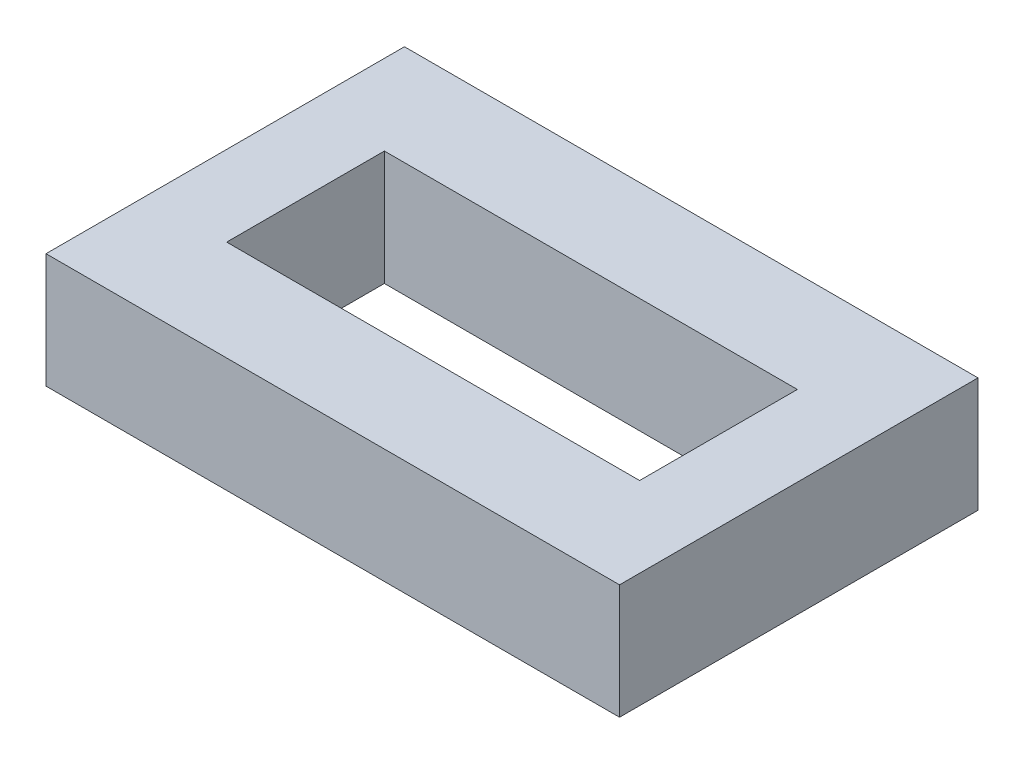
ISO-10303-21;
HEADER;
FILE_DESCRIPTION(('STEP AP214'),'2;1');
FILE_NAME('part.step','',(''),(''),'','','');
FILE_SCHEMA(('AUTOMOTIVE_DESIGN { 1 0 10303 214 1 1 1 1 }'));
ENDSEC;
DATA;
#1=APPLICATION_CONTEXT('core data for automotive mechanical design processes');
#2=APPLICATION_PROTOCOL_DEFINITION('international standard','automotive_design',2000,#1);
#3=PRODUCT_CONTEXT('',#1,'mechanical');
#4=PRODUCT('Part','Part','',(#3));
#5=PRODUCT_RELATED_PRODUCT_CATEGORY('part','',(#4));
#6=PRODUCT_DEFINITION_FORMATION('','',#4);
#7=PRODUCT_DEFINITION_CONTEXT('part definition',#1,'design');
#8=PRODUCT_DEFINITION('design','',#6,#7);
#9=PRODUCT_DEFINITION_SHAPE('','',#8);
#10=(LENGTH_UNIT() NAMED_UNIT(*) SI_UNIT(.MILLI.,.METRE.));
#11=(NAMED_UNIT(*) PLANE_ANGLE_UNIT() SI_UNIT($,.RADIAN.));
#12=(NAMED_UNIT(*) SI_UNIT($,.STERADIAN.) SOLID_ANGLE_UNIT());
#13=UNCERTAINTY_MEASURE_WITH_UNIT(LENGTH_MEASURE(1.E-05),#10,'distance_accuracy_value','');
#14=(GEOMETRIC_REPRESENTATION_CONTEXT(3) GLOBAL_UNCERTAINTY_ASSIGNED_CONTEXT((#13)) GLOBAL_UNIT_ASSIGNED_CONTEXT((#10,
#11,#12)) REPRESENTATION_CONTEXT('',''));
#15=CARTESIAN_POINT('',(0.,0.,0.));
#16=DIRECTION('',(0.,0.,1.));
#17=DIRECTION('',(1.,0.,0.));
#18=AXIS2_PLACEMENT_3D('',#15,#16,#17);
#19=CARTESIAN_POINT('',(0.,10.16,0.));
#20=DIRECTION('',(0.,-1.,0.));
#21=DIRECTION('',(0.,0.,-1.));
#22=AXIS2_PLACEMENT_3D('',#19,#20,#21);
#23=PLANE('',#22);
#24=DIRECTION('',(0.,0.,-1.));
#25=VECTOR('',#24,1.);
#26=CARTESIAN_POINT('',(25.4,10.16,15.875));
#27=LINE('',#26,#25);
#28=CARTESIAN_POINT('',(25.4,10.16,15.875));
#29=VERTEX_POINT('',#28);
#30=CARTESIAN_POINT('',(25.4,10.16,-15.875));
#31=VERTEX_POINT('',#30);
#32=EDGE_CURVE('E134',#29,#31,#27,.T.);
#33=ORIENTED_EDGE('',*,*,#32,.T.);
#34=DIRECTION('',(-1.,0.,0.));
#35=VECTOR('',#34,1.);
#36=CARTESIAN_POINT('',(-25.4,10.16,-15.875));
#37=LINE('',#36,#35);
#38=CARTESIAN_POINT('',(-25.4,10.16,-15.875));
#39=VERTEX_POINT('',#38);
#40=EDGE_CURVE('E137',#31,#39,#37,.T.);
#41=ORIENTED_EDGE('',*,*,#40,.T.);
#42=DIRECTION('',(0.,0.,1.));
#43=VECTOR('',#42,1.);
#44=CARTESIAN_POINT('',(-25.4,10.16,15.875));
#45=LINE('',#44,#43);
#46=CARTESIAN_POINT('',(-25.4,10.16,15.875));
#47=VERTEX_POINT('',#46);
#48=EDGE_CURVE('E140',#39,#47,#45,.T.);
#49=ORIENTED_EDGE('',*,*,#48,.T.);
#50=DIRECTION('',(1.,0.,0.));
#51=VECTOR('',#50,1.);
#52=CARTESIAN_POINT('',(-25.4,10.16,15.875));
#53=LINE('',#52,#51);
#54=EDGE_CURVE('E142',#47,#29,#53,.T.);
#55=ORIENTED_EDGE('',*,*,#54,.T.);
#56=EDGE_LOOP('',(#33,#41,#49,#55));
#57=FACE_BOUND('',#56,.T.);
#58=DIRECTION('',(0.,0.,-1.));
#59=VECTOR('',#58,1.);
#60=CARTESIAN_POINT('',(18.288,10.16,6.985));
#61=LINE('',#60,#59);
#62=CARTESIAN_POINT('',(18.288,10.16,6.985));
#63=VERTEX_POINT('',#62);
#64=CARTESIAN_POINT('',(18.288,10.16,-6.985));
#65=VERTEX_POINT('',#64);
#66=EDGE_CURVE('E98',#63,#65,#61,.T.);
#67=ORIENTED_EDGE('',*,*,#66,.F.);
#68=DIRECTION('',(1.,0.,0.));
#69=VECTOR('',#68,1.);
#70=CARTESIAN_POINT('',(-18.288,10.16,6.985));
#71=LINE('',#70,#69);
#72=CARTESIAN_POINT('',(-18.288,10.16,6.985));
#73=VERTEX_POINT('',#72);
#74=EDGE_CURVE('E120',#73,#63,#71,.T.);
#75=ORIENTED_EDGE('',*,*,#74,.F.);
#76=DIRECTION('',(0.,0.,1.));
#77=VECTOR('',#76,1.);
#78=CARTESIAN_POINT('',(-18.288,10.16,6.985));
#79=LINE('',#78,#77);
#80=CARTESIAN_POINT('',(-18.288,10.16,-6.985));
#81=VERTEX_POINT('',#80);
#82=EDGE_CURVE('E118',#81,#73,#79,.T.);
#83=ORIENTED_EDGE('',*,*,#82,.F.);
#84=DIRECTION('',(-1.,0.,0.));
#85=VECTOR('',#84,1.);
#86=CARTESIAN_POINT('',(-18.288,10.16,-6.985));
#87=LINE('',#86,#85);
#88=EDGE_CURVE('E106',#65,#81,#87,.T.);
#89=ORIENTED_EDGE('',*,*,#88,.F.);
#90=EDGE_LOOP('',(#67,#75,#83,#89));
#91=FACE_BOUND('',#90,.T.);
#92=ADVANCED_FACE('F33',(#57,#91),#23,.F.);
#93=CARTESIAN_POINT('',(0.,0.,0.));
#94=DIRECTION('',(0.,-1.,0.));
#95=DIRECTION('',(0.,0.,-1.));
#96=AXIS2_PLACEMENT_3D('',#93,#94,#95);
#97=PLANE('',#96);
#98=DIRECTION('',(0.,0.,-1.));
#99=VECTOR('',#98,1.);
#100=CARTESIAN_POINT('',(25.4,0.,15.875));
#101=LINE('',#100,#99);
#102=CARTESIAN_POINT('',(25.4,0.,15.875));
#103=VERTEX_POINT('',#102);
#104=CARTESIAN_POINT('',(25.4,0.,-15.875));
#105=VERTEX_POINT('',#104);
#106=EDGE_CURVE('E114',#103,#105,#101,.T.);
#107=ORIENTED_EDGE('',*,*,#106,.F.);
#108=DIRECTION('',(1.,0.,0.));
#109=VECTOR('',#108,1.);
#110=CARTESIAN_POINT('',(-25.4,0.,15.875));
#111=LINE('',#110,#109);
#112=CARTESIAN_POINT('',(-25.4,0.,15.875));
#113=VERTEX_POINT('',#112);
#114=EDGE_CURVE('E138',#113,#103,#111,.T.);
#115=ORIENTED_EDGE('',*,*,#114,.F.);
#116=DIRECTION('',(0.,0.,1.));
#117=VECTOR('',#116,1.);
#118=CARTESIAN_POINT('',(-25.4,0.,15.875));
#119=LINE('',#118,#117);
#120=CARTESIAN_POINT('',(-25.4,0.,-15.875));
#121=VERTEX_POINT('',#120);
#122=EDGE_CURVE('E149',#121,#113,#119,.T.);
#123=ORIENTED_EDGE('',*,*,#122,.F.);
#124=DIRECTION('',(-1.,0.,0.));
#125=VECTOR('',#124,1.);
#126=CARTESIAN_POINT('',(-25.4,0.,-15.875));
#127=LINE('',#126,#125);
#128=EDGE_CURVE('E147',#105,#121,#127,.T.);
#129=ORIENTED_EDGE('',*,*,#128,.F.);
#130=EDGE_LOOP('',(#107,#115,#123,#129));
#131=FACE_BOUND('',#130,.T.);
#132=DIRECTION('',(1.,0.,0.));
#133=VECTOR('',#132,1.);
#134=CARTESIAN_POINT('',(-18.288,0.,6.985));
#135=LINE('',#134,#133);
#136=CARTESIAN_POINT('',(-18.288,0.,6.985));
#137=VERTEX_POINT('',#136);
#138=CARTESIAN_POINT('',(18.288,0.,6.985));
#139=VERTEX_POINT('',#138);
#140=EDGE_CURVE('E107',#137,#139,#135,.T.);
#141=ORIENTED_EDGE('',*,*,#140,.T.);
#142=DIRECTION('',(0.,0.,-1.));
#143=VECTOR('',#142,1.);
#144=CARTESIAN_POINT('',(18.288,0.,6.985));
#145=LINE('',#144,#143);
#146=CARTESIAN_POINT('',(18.288,0.,-6.985));
#147=VERTEX_POINT('',#146);
#148=EDGE_CURVE('E56',#139,#147,#145,.T.);
#149=ORIENTED_EDGE('',*,*,#148,.T.);
#150=DIRECTION('',(-1.,0.,0.));
#151=VECTOR('',#150,1.);
#152=CARTESIAN_POINT('',(-18.288,0.,-6.985));
#153=LINE('',#152,#151);
#154=CARTESIAN_POINT('',(-18.288,0.,-6.985));
#155=VERTEX_POINT('',#154);
#156=EDGE_CURVE('E113',#147,#155,#153,.T.);
#157=ORIENTED_EDGE('',*,*,#156,.T.);
#158=DIRECTION('',(0.,0.,1.));
#159=VECTOR('',#158,1.);
#160=CARTESIAN_POINT('',(-18.288,0.,6.985));
#161=LINE('',#160,#159);
#162=EDGE_CURVE('E126',#155,#137,#161,.T.);
#163=ORIENTED_EDGE('',*,*,#162,.T.);
#164=EDGE_LOOP('',(#141,#149,#157,#163));
#165=FACE_BOUND('',#164,.T.);
#166=ADVANCED_FACE('F167',(#131,#165),#97,.T.);
#167=CARTESIAN_POINT('',(25.4,10.16,15.875));
#168=DIRECTION('',(-1.,0.,0.));
#169=DIRECTION('',(0.,0.,1.));
#170=AXIS2_PLACEMENT_3D('',#167,#168,#169);
#171=PLANE('',#170);
#172=ORIENTED_EDGE('',*,*,#106,.T.);
#173=DIRECTION('',(0.,-1.,0.));
#174=VECTOR('',#173,1.);
#175=CARTESIAN_POINT('',(25.4,10.16,-15.875));
#176=LINE('',#175,#174);
#177=EDGE_CURVE('E11',#31,#105,#176,.T.);
#178=ORIENTED_EDGE('',*,*,#177,.F.);
#179=ORIENTED_EDGE('',*,*,#32,.F.);
#180=DIRECTION('',(0.,-1.,0.));
#181=VECTOR('',#180,1.);
#182=CARTESIAN_POINT('',(25.4,10.16,15.875));
#183=LINE('',#182,#181);
#184=EDGE_CURVE('E144',#29,#103,#183,.T.);
#185=ORIENTED_EDGE('',*,*,#184,.T.);
#186=EDGE_LOOP('',(#172,#178,#179,#185));
#187=FACE_BOUND('',#186,.T.);
#188=ADVANCED_FACE('F35',(#187),#171,.F.);
#189=CARTESIAN_POINT('',(-25.4,10.16,-15.875));
#190=DIRECTION('',(0.,0.,1.));
#191=DIRECTION('',(1.,0.,0.));
#192=AXIS2_PLACEMENT_3D('',#189,#190,#191);
#193=PLANE('',#192);
#194=ORIENTED_EDGE('',*,*,#128,.T.);
#195=DIRECTION('',(0.,-1.,0.));
#196=VECTOR('',#195,1.);
#197=CARTESIAN_POINT('',(-25.4,10.16,-15.875));
#198=LINE('',#197,#196);
#199=EDGE_CURVE('E41',#39,#121,#198,.T.);
#200=ORIENTED_EDGE('',*,*,#199,.F.);
#201=ORIENTED_EDGE('',*,*,#40,.F.);
#202=ORIENTED_EDGE('',*,*,#177,.T.);
#203=EDGE_LOOP('',(#194,#200,#201,#202));
#204=FACE_BOUND('',#203,.T.);
#205=ADVANCED_FACE('F177',(#204),#193,.F.);
#206=CARTESIAN_POINT('',(-25.4,10.16,15.875));
#207=DIRECTION('',(1.,0.,0.));
#208=DIRECTION('',(0.,0.,-1.));
#209=AXIS2_PLACEMENT_3D('',#206,#207,#208);
#210=PLANE('',#209);
#211=ORIENTED_EDGE('',*,*,#122,.T.);
#212=DIRECTION('',(0.,-1.,0.));
#213=VECTOR('',#212,1.);
#214=CARTESIAN_POINT('',(-25.4,10.16,15.875));
#215=LINE('',#214,#213);
#216=EDGE_CURVE('E154',#47,#113,#215,.T.);
#217=ORIENTED_EDGE('',*,*,#216,.F.);
#218=ORIENTED_EDGE('',*,*,#48,.F.);
#219=ORIENTED_EDGE('',*,*,#199,.T.);
#220=EDGE_LOOP('',(#211,#217,#218,#219));
#221=FACE_BOUND('',#220,.T.);
#222=ADVANCED_FACE('F161',(#221),#210,.F.);
#223=CARTESIAN_POINT('',(-25.4,10.16,15.875));
#224=DIRECTION('',(0.,0.,-1.));
#225=DIRECTION('',(-1.,0.,0.));
#226=AXIS2_PLACEMENT_3D('',#223,#224,#225);
#227=PLANE('',#226);
#228=ORIENTED_EDGE('',*,*,#114,.T.);
#229=ORIENTED_EDGE('',*,*,#184,.F.);
#230=ORIENTED_EDGE('',*,*,#54,.F.);
#231=ORIENTED_EDGE('',*,*,#216,.T.);
#232=EDGE_LOOP('',(#228,#229,#230,#231));
#233=FACE_BOUND('',#232,.T.);
#234=ADVANCED_FACE('F171',(#233),#227,.F.);
#235=CARTESIAN_POINT('',(18.288,10.16,6.985));
#236=DIRECTION('',(-1.,0.,0.));
#237=DIRECTION('',(0.,0.,1.));
#238=AXIS2_PLACEMENT_3D('',#235,#236,#237);
#239=PLANE('',#238);
#240=ORIENTED_EDGE('',*,*,#148,.F.);
#241=DIRECTION('',(0.,-1.,0.));
#242=VECTOR('',#241,1.);
#243=CARTESIAN_POINT('',(18.288,10.16,6.985));
#244=LINE('',#243,#242);
#245=EDGE_CURVE('E102',#63,#139,#244,.T.);
#246=ORIENTED_EDGE('',*,*,#245,.F.);
#247=ORIENTED_EDGE('',*,*,#66,.T.);
#248=DIRECTION('',(0.,-1.,0.));
#249=VECTOR('',#248,1.);
#250=CARTESIAN_POINT('',(18.288,10.16,-6.985));
#251=LINE('',#250,#249);
#252=EDGE_CURVE('E101',#65,#147,#251,.T.);
#253=ORIENTED_EDGE('',*,*,#252,.T.);
#254=EDGE_LOOP('',(#240,#246,#247,#253));
#255=FACE_BOUND('',#254,.T.);
#256=ADVANCED_FACE('F100',(#255),#239,.T.);
#257=CARTESIAN_POINT('',(-18.288,10.16,-6.985));
#258=DIRECTION('',(0.,0.,1.));
#259=DIRECTION('',(1.,0.,0.));
#260=AXIS2_PLACEMENT_3D('',#257,#258,#259);
#261=PLANE('',#260);
#262=ORIENTED_EDGE('',*,*,#156,.F.);
#263=ORIENTED_EDGE('',*,*,#252,.F.);
#264=ORIENTED_EDGE('',*,*,#88,.T.);
#265=DIRECTION('',(0.,-1.,0.));
#266=VECTOR('',#265,1.);
#267=CARTESIAN_POINT('',(-18.288,10.16,-6.985));
#268=LINE('',#267,#266);
#269=EDGE_CURVE('E115',#81,#155,#268,.T.);
#270=ORIENTED_EDGE('',*,*,#269,.T.);
#271=EDGE_LOOP('',(#262,#263,#264,#270));
#272=FACE_BOUND('',#271,.T.);
#273=ADVANCED_FACE('F110',(#272),#261,.T.);
#274=CARTESIAN_POINT('',(-18.288,10.16,6.985));
#275=DIRECTION('',(1.,0.,0.));
#276=DIRECTION('',(0.,0.,-1.));
#277=AXIS2_PLACEMENT_3D('',#274,#275,#276);
#278=PLANE('',#277);
#279=ORIENTED_EDGE('',*,*,#162,.F.);
#280=ORIENTED_EDGE('',*,*,#269,.F.);
#281=ORIENTED_EDGE('',*,*,#82,.T.);
#282=DIRECTION('',(0.,-1.,0.));
#283=VECTOR('',#282,1.);
#284=CARTESIAN_POINT('',(-18.288,10.16,6.985));
#285=LINE('',#284,#283);
#286=EDGE_CURVE('E48',#73,#137,#285,.T.);
#287=ORIENTED_EDGE('',*,*,#286,.T.);
#288=EDGE_LOOP('',(#279,#280,#281,#287));
#289=FACE_BOUND('',#288,.T.);
#290=ADVANCED_FACE('F200',(#289),#278,.T.);
#291=CARTESIAN_POINT('',(-18.288,10.16,6.985));
#292=DIRECTION('',(0.,0.,-1.));
#293=DIRECTION('',(-1.,0.,0.));
#294=AXIS2_PLACEMENT_3D('',#291,#292,#293);
#295=PLANE('',#294);
#296=ORIENTED_EDGE('',*,*,#140,.F.);
#297=ORIENTED_EDGE('',*,*,#286,.F.);
#298=ORIENTED_EDGE('',*,*,#74,.T.);
#299=ORIENTED_EDGE('',*,*,#245,.T.);
#300=EDGE_LOOP('',(#296,#297,#298,#299));
#301=FACE_BOUND('',#300,.T.);
#302=ADVANCED_FACE('F204',(#301),#295,.T.);
#303=CLOSED_SHELL('',(#92,#166,#188,#205,#222,#234,#256,#273,#290,#302));
#304=MANIFOLD_SOLID_BREP('B2',#303);
#305=ADVANCED_BREP_SHAPE_REPRESENTATION('',(#18,#304),#14);
#306=SHAPE_DEFINITION_REPRESENTATION(#9,#305);
ENDSEC;
END-ISO-10303-21;
